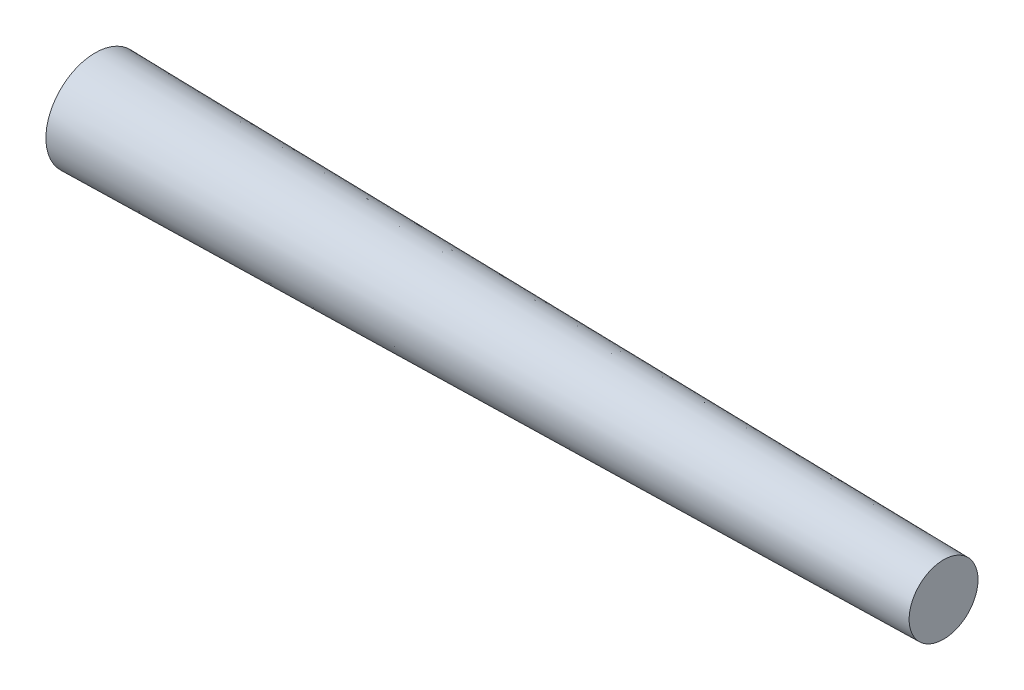
ISO-10303-21;
HEADER;
FILE_DESCRIPTION(('STEP AP214'),'2;1');
FILE_NAME('part.step','',(''),(''),'','','');
FILE_SCHEMA(('AUTOMOTIVE_DESIGN { 1 0 10303 214 1 1 1 1 }'));
ENDSEC;
DATA;
#1=APPLICATION_CONTEXT('core data for automotive mechanical design processes');
#2=APPLICATION_PROTOCOL_DEFINITION('international standard','automotive_design',2000,#1);
#3=PRODUCT_CONTEXT('',#1,'mechanical');
#4=PRODUCT('Part','Part','',(#3));
#5=PRODUCT_RELATED_PRODUCT_CATEGORY('part','',(#4));
#6=PRODUCT_DEFINITION_FORMATION('','',#4);
#7=PRODUCT_DEFINITION_CONTEXT('part definition',#1,'design');
#8=PRODUCT_DEFINITION('design','',#6,#7);
#9=PRODUCT_DEFINITION_SHAPE('','',#8);
#10=(LENGTH_UNIT() NAMED_UNIT(*) SI_UNIT(.MILLI.,.METRE.));
#11=(NAMED_UNIT(*) PLANE_ANGLE_UNIT() SI_UNIT($,.RADIAN.));
#12=(NAMED_UNIT(*) SI_UNIT($,.STERADIAN.) SOLID_ANGLE_UNIT());
#13=UNCERTAINTY_MEASURE_WITH_UNIT(LENGTH_MEASURE(1.E-05),#10,'distance_accuracy_value','');
#14=(GEOMETRIC_REPRESENTATION_CONTEXT(3) GLOBAL_UNCERTAINTY_ASSIGNED_CONTEXT((#13)) GLOBAL_UNIT_ASSIGNED_CONTEXT((#10,
#11,#12)) REPRESENTATION_CONTEXT('',''));
#15=CARTESIAN_POINT('',(0.,0.,0.));
#16=DIRECTION('',(0.,0.,1.));
#17=DIRECTION('',(1.,0.,0.));
#18=AXIS2_PLACEMENT_3D('',#15,#16,#17);
#19=CARTESIAN_POINT('',(0.,0.,0.));
#20=DIRECTION('',(-1.,0.,0.));
#21=DIRECTION('',(0.,0.,-1.));
#22=AXIS2_PLACEMENT_3D('',#19,#20,#21);
#23=CONICAL_SURFACE('',#22,5.05,0.0174532925199433);
#24=CARTESIAN_POINT('',(87.,0.,0.));
#25=DIRECTION('',(1.,0.,0.));
#26=DIRECTION('',(0.,0.,-1.));
#27=AXIS2_PLACEMENT_3D('',#24,#25,#26);
#28=CIRCLE('',#27,3.53140935124507);
#29=CARTESIAN_POINT('',(87.,0.,-3.53140935124507));
#30=VERTEX_POINT('',#29);
#31=EDGE_CURVE('E11',#30,#30,#28,.T.);
#32=ORIENTED_EDGE('',*,*,#31,.F.);
#33=EDGE_LOOP('',(#32));
#34=FACE_BOUND('',#33,.T.);
#35=CARTESIAN_POINT('',(0.,0.,0.));
#36=DIRECTION('',(1.,0.,0.));
#37=DIRECTION('',(0.,0.,-1.));
#38=AXIS2_PLACEMENT_3D('',#35,#36,#37);
#39=CIRCLE('',#38,5.05);
#40=CARTESIAN_POINT('',(0.,0.,-5.05));
#41=VERTEX_POINT('',#40);
#42=EDGE_CURVE('E48',#41,#41,#39,.T.);
#43=ORIENTED_EDGE('',*,*,#42,.T.);
#44=EDGE_LOOP('',(#43));
#45=FACE_BOUND('',#44,.T.);
#46=ADVANCED_FACE('F41',(#34,#45),#23,.T.);
#47=CARTESIAN_POINT('',(87.,0.,0.));
#48=DIRECTION('',(1.,0.,0.));
#49=DIRECTION('',(0.,0.,-1.));
#50=AXIS2_PLACEMENT_3D('',#47,#48,#49);
#51=PLANE('',#50);
#52=ORIENTED_EDGE('',*,*,#31,.T.);
#53=EDGE_LOOP('',(#52));
#54=FACE_BOUND('',#53,.T.);
#55=ADVANCED_FACE('F125',(#54),#51,.T.);
#56=CARTESIAN_POINT('',(0.,0.,0.));
#57=DIRECTION('',(1.,0.,0.));
#58=DIRECTION('',(0.,0.,-1.));
#59=AXIS2_PLACEMENT_3D('',#56,#57,#58);
#60=PLANE('',#59);
#61=DIRECTION('',(0.,-1.,0.));
#62=VECTOR('',#61,1.);
#63=CARTESIAN_POINT('',(0.,0.5,1.));
#64=LINE('',#63,#62);
#65=CARTESIAN_POINT('',(0.,0.5,1.));
#66=VERTEX_POINT('',#65);
#67=CARTESIAN_POINT('',(0.,-0.5,1.));
#68=VERTEX_POINT('',#67);
#69=EDGE_CURVE('E106',#66,#68,#64,.T.);
#70=ORIENTED_EDGE('',*,*,#69,.T.);
#71=DIRECTION('',(0.,0.,-1.));
#72=VECTOR('',#71,1.);
#73=CARTESIAN_POINT('',(0.,-0.5,-1.));
#74=LINE('',#73,#72);
#75=CARTESIAN_POINT('',(0.,-0.5,-1.));
#76=VERTEX_POINT('',#75);
#77=EDGE_CURVE('E55',#68,#76,#74,.T.);
#78=ORIENTED_EDGE('',*,*,#77,.T.);
#79=DIRECTION('',(0.,-1.,0.));
#80=VECTOR('',#79,1.);
#81=CARTESIAN_POINT('',(0.,0.5,-1.));
#82=LINE('',#81,#80);
#83=CARTESIAN_POINT('',(0.,0.5,-1.));
#84=VERTEX_POINT('',#83);
#85=EDGE_CURVE('E101',#84,#76,#82,.T.);
#86=ORIENTED_EDGE('',*,*,#85,.F.);
#87=DIRECTION('',(0.,0.,-1.));
#88=VECTOR('',#87,1.);
#89=CARTESIAN_POINT('',(0.,0.5,-1.));
#90=LINE('',#89,#88);
#91=EDGE_CURVE('E95',#66,#84,#90,.T.);
#92=ORIENTED_EDGE('',*,*,#91,.F.);
#93=EDGE_LOOP('',(#70,#78,#86,#92));
#94=FACE_BOUND('',#93,.T.);
#95=ORIENTED_EDGE('',*,*,#42,.F.);
#96=EDGE_LOOP('',(#95));
#97=FACE_BOUND('',#96,.T.);
#98=ADVANCED_FACE('F123',(#94,#97),#60,.F.);
#99=CARTESIAN_POINT('',(-1.,0.5,0.));
#100=DIRECTION('',(0.,1.,0.));
#101=DIRECTION('',(0.,0.,1.));
#102=AXIS2_PLACEMENT_3D('',#99,#100,#101);
#103=PLANE('',#102);
#104=ORIENTED_EDGE('',*,*,#91,.T.);
#105=DIRECTION('',(-1.,0.,0.));
#106=VECTOR('',#105,1.);
#107=CARTESIAN_POINT('',(0.,0.5,-1.));
#108=LINE('',#107,#106);
#109=CARTESIAN_POINT('',(-1.,0.5,-1.));
#110=VERTEX_POINT('',#109);
#111=EDGE_CURVE('E89',#84,#110,#108,.T.);
#112=ORIENTED_EDGE('',*,*,#111,.T.);
#113=CARTESIAN_POINT('',(-1.,0.5,0.));
#114=DIRECTION('',(0.,1.,0.));
#115=DIRECTION('',(0.,0.,1.));
#116=AXIS2_PLACEMENT_3D('',#113,#114,#115);
#117=CIRCLE('',#116,1.);
#118=CARTESIAN_POINT('',(-1.,0.5,1.));
#119=VERTEX_POINT('',#118);
#120=EDGE_CURVE('E93',#110,#119,#117,.T.);
#121=ORIENTED_EDGE('',*,*,#120,.T.);
#122=DIRECTION('',(1.,0.,0.));
#123=VECTOR('',#122,1.);
#124=CARTESIAN_POINT('',(-1.,0.5,1.));
#125=LINE('',#124,#123);
#126=EDGE_CURVE('E64',#119,#66,#125,.T.);
#127=ORIENTED_EDGE('',*,*,#126,.T.);
#128=EDGE_LOOP('',(#104,#112,#121,#127));
#129=FACE_BOUND('',#128,.T.);
#130=CARTESIAN_POINT('',(-1.,0.5,0.));
#131=DIRECTION('',(0.,1.,0.));
#132=DIRECTION('',(0.,0.,1.));
#133=AXIS2_PLACEMENT_3D('',#130,#131,#132);
#134=CIRCLE('',#133,0.5);
#135=CARTESIAN_POINT('',(-1.,0.5,0.5));
#136=VERTEX_POINT('',#135);
#137=EDGE_CURVE('E111',#136,#136,#134,.T.);
#138=ORIENTED_EDGE('',*,*,#137,.F.);
#139=EDGE_LOOP('',(#138));
#140=FACE_BOUND('',#139,.T.);
#141=ADVANCED_FACE('F90',(#129,#140),#103,.T.);
#142=CARTESIAN_POINT('',(-1.,-0.5,0.));
#143=DIRECTION('',(0.,1.,0.));
#144=DIRECTION('',(0.,0.,1.));
#145=AXIS2_PLACEMENT_3D('',#142,#143,#144);
#146=PLANE('',#145);
#147=ORIENTED_EDGE('',*,*,#77,.F.);
#148=DIRECTION('',(1.,0.,0.));
#149=VECTOR('',#148,1.);
#150=CARTESIAN_POINT('',(-1.,-0.5,1.));
#151=LINE('',#150,#149);
#152=CARTESIAN_POINT('',(-1.,-0.5,1.));
#153=VERTEX_POINT('',#152);
#154=EDGE_CURVE('E114',#153,#68,#151,.T.);
#155=ORIENTED_EDGE('',*,*,#154,.F.);
#156=CARTESIAN_POINT('',(-1.,-0.5,0.));
#157=DIRECTION('',(0.,1.,0.));
#158=DIRECTION('',(0.,0.,1.));
#159=AXIS2_PLACEMENT_3D('',#156,#157,#158);
#160=CIRCLE('',#159,1.);
#161=CARTESIAN_POINT('',(-1.,-0.5,-1.));
#162=VERTEX_POINT('',#161);
#163=EDGE_CURVE('E81',#162,#153,#160,.T.);
#164=ORIENTED_EDGE('',*,*,#163,.F.);
#165=DIRECTION('',(-1.,0.,0.));
#166=VECTOR('',#165,1.);
#167=CARTESIAN_POINT('',(0.,-0.5,-1.));
#168=LINE('',#167,#166);
#169=EDGE_CURVE('E100',#76,#162,#168,.T.);
#170=ORIENTED_EDGE('',*,*,#169,.F.);
#171=EDGE_LOOP('',(#147,#155,#164,#170));
#172=FACE_BOUND('',#171,.T.);
#173=CARTESIAN_POINT('',(-1.,-0.5,0.));
#174=DIRECTION('',(0.,1.,0.));
#175=DIRECTION('',(0.,0.,1.));
#176=AXIS2_PLACEMENT_3D('',#173,#174,#175);
#177=CIRCLE('',#176,0.5);
#178=CARTESIAN_POINT('',(-1.,-0.5,0.5));
#179=VERTEX_POINT('',#178);
#180=EDGE_CURVE('E208',#179,#179,#177,.T.);
#181=ORIENTED_EDGE('',*,*,#180,.T.);
#182=EDGE_LOOP('',(#181));
#183=FACE_BOUND('',#182,.T.);
#184=ADVANCED_FACE('F131',(#172,#183),#146,.F.);
#185=CARTESIAN_POINT('',(0.,0.5,-1.));
#186=DIRECTION('',(0.,0.,1.));
#187=DIRECTION('',(1.,0.,0.));
#188=AXIS2_PLACEMENT_3D('',#185,#186,#187);
#189=PLANE('',#188);
#190=ORIENTED_EDGE('',*,*,#169,.T.);
#191=DIRECTION('',(0.,-1.,0.));
#192=VECTOR('',#191,1.);
#193=CARTESIAN_POINT('',(-1.,0.5,-1.));
#194=LINE('',#193,#192);
#195=EDGE_CURVE('E98',#110,#162,#194,.T.);
#196=ORIENTED_EDGE('',*,*,#195,.F.);
#197=ORIENTED_EDGE('',*,*,#111,.F.);
#198=ORIENTED_EDGE('',*,*,#85,.T.);
#199=EDGE_LOOP('',(#190,#196,#197,#198));
#200=FACE_BOUND('',#199,.T.);
#201=ADVANCED_FACE('F99',(#200),#189,.F.);
#202=CARTESIAN_POINT('',(-1.,0.5,0.));
#203=DIRECTION('',(0.,-1.,0.));
#204=DIRECTION('',(0.,0.,-1.));
#205=AXIS2_PLACEMENT_3D('',#202,#203,#204);
#206=CYLINDRICAL_SURFACE('',#205,1.);
#207=ORIENTED_EDGE('',*,*,#163,.T.);
#208=DIRECTION('',(0.,-1.,0.));
#209=VECTOR('',#208,1.);
#210=CARTESIAN_POINT('',(-1.,0.5,1.));
#211=LINE('',#210,#209);
#212=EDGE_CURVE('E102',#119,#153,#211,.T.);
#213=ORIENTED_EDGE('',*,*,#212,.F.);
#214=ORIENTED_EDGE('',*,*,#120,.F.);
#215=ORIENTED_EDGE('',*,*,#195,.T.);
#216=EDGE_LOOP('',(#207,#213,#214,#215));
#217=FACE_BOUND('',#216,.T.);
#218=ADVANCED_FACE('F104',(#217),#206,.T.);
#219=CARTESIAN_POINT('',(-1.,0.5,1.));
#220=DIRECTION('',(0.,0.,-1.));
#221=DIRECTION('',(-1.,0.,0.));
#222=AXIS2_PLACEMENT_3D('',#219,#220,#221);
#223=PLANE('',#222);
#224=ORIENTED_EDGE('',*,*,#154,.T.);
#225=ORIENTED_EDGE('',*,*,#69,.F.);
#226=ORIENTED_EDGE('',*,*,#126,.F.);
#227=ORIENTED_EDGE('',*,*,#212,.T.);
#228=EDGE_LOOP('',(#224,#225,#226,#227));
#229=FACE_BOUND('',#228,.T.);
#230=ADVANCED_FACE('F181',(#229),#223,.F.);
#231=CARTESIAN_POINT('',(-1.,0.5,0.));
#232=DIRECTION('',(0.,-1.,0.));
#233=DIRECTION('',(0.,0.,-1.));
#234=AXIS2_PLACEMENT_3D('',#231,#232,#233);
#235=CYLINDRICAL_SURFACE('',#234,0.5);
#236=ORIENTED_EDGE('',*,*,#137,.T.);
#237=EDGE_LOOP('',(#236));
#238=FACE_BOUND('',#237,.T.);
#239=ORIENTED_EDGE('',*,*,#180,.F.);
#240=EDGE_LOOP('',(#239));
#241=FACE_BOUND('',#240,.T.);
#242=ADVANCED_FACE('F190',(#238,#241),#235,.F.);
#243=CLOSED_SHELL('',(#46,#55,#98,#141,#184,#201,#218,#230,#242));
#244=MANIFOLD_SOLID_BREP('B2',#243);
#245=ADVANCED_BREP_SHAPE_REPRESENTATION('',(#18,#244),#14);
#246=SHAPE_DEFINITION_REPRESENTATION(#9,#245);
ENDSEC;
END-ISO-10303-21;
